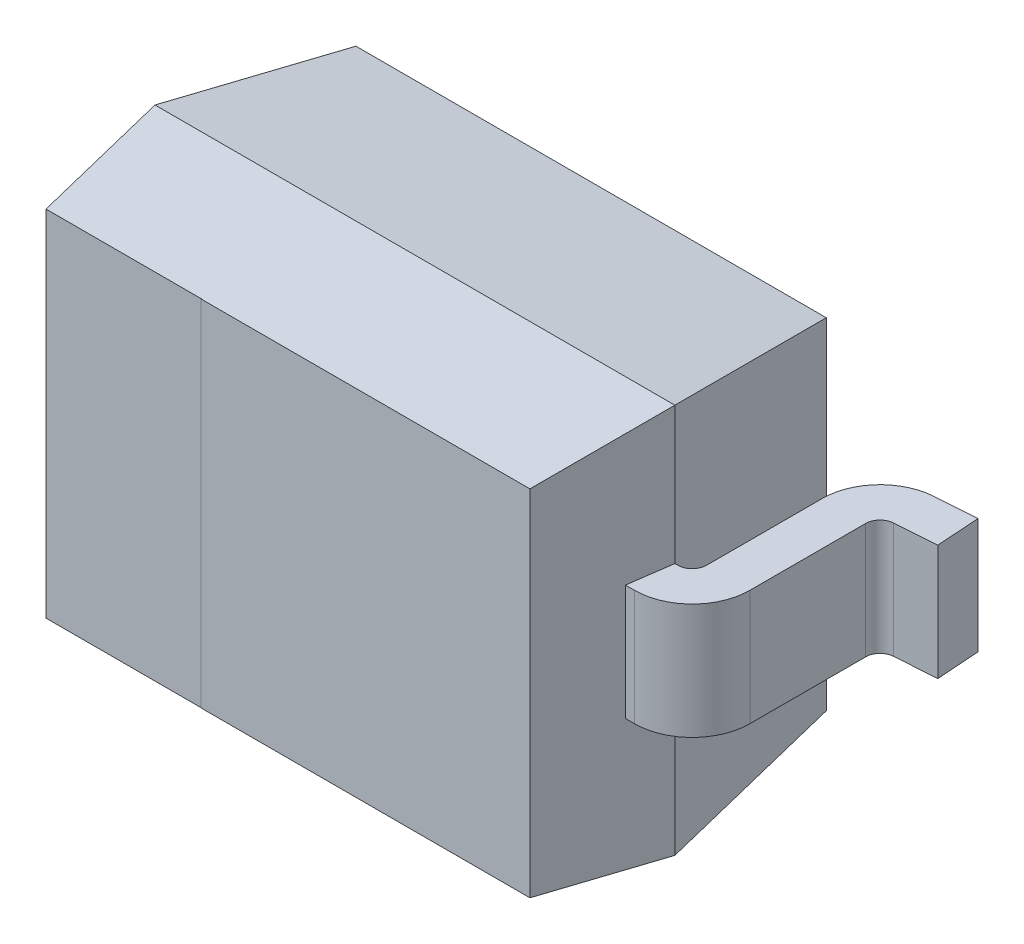
ISO-10303-21;
HEADER;
FILE_DESCRIPTION(('STEP AP214'),'2;1');
FILE_NAME('part.step','',(''),(''),'','','');
FILE_SCHEMA(('AUTOMOTIVE_DESIGN { 1 0 10303 214 1 1 1 1 }'));
ENDSEC;
DATA;
#1=APPLICATION_CONTEXT('core data for automotive mechanical design processes');
#2=APPLICATION_PROTOCOL_DEFINITION('international standard','automotive_design',2000,#1);
#3=PRODUCT_CONTEXT('',#1,'mechanical');
#4=PRODUCT('Part','Part','',(#3));
#5=PRODUCT_RELATED_PRODUCT_CATEGORY('part','',(#4));
#6=PRODUCT_DEFINITION_FORMATION('','',#4);
#7=PRODUCT_DEFINITION_CONTEXT('part definition',#1,'design');
#8=PRODUCT_DEFINITION('design','',#6,#7);
#9=PRODUCT_DEFINITION_SHAPE('','',#8);
#10=(LENGTH_UNIT() NAMED_UNIT(*) SI_UNIT(.MILLI.,.METRE.));
#11=(NAMED_UNIT(*) PLANE_ANGLE_UNIT() SI_UNIT($,.RADIAN.));
#12=(NAMED_UNIT(*) SI_UNIT($,.STERADIAN.) SOLID_ANGLE_UNIT());
#13=UNCERTAINTY_MEASURE_WITH_UNIT(LENGTH_MEASURE(1.E-05),#10,'distance_accuracy_value','');
#14=(GEOMETRIC_REPRESENTATION_CONTEXT(3) GLOBAL_UNCERTAINTY_ASSIGNED_CONTEXT((#13)) GLOBAL_UNIT_ASSIGNED_CONTEXT((#10,
#11,#12)) REPRESENTATION_CONTEXT('',''));
#15=CARTESIAN_POINT('',(0.,0.,0.));
#16=DIRECTION('',(0.,0.,1.));
#17=DIRECTION('',(1.,0.,0.));
#18=AXIS2_PLACEMENT_3D('',#15,#16,#17);
#19=CARTESIAN_POINT('',(-0.9,0.675,0.66));
#20=DIRECTION('',(0.,0.990268068741588,-0.139173100959942));
#21=DIRECTION('',(0.,0.139173100959942,0.990268068741588));
#22=AXIS2_PLACEMENT_3D('',#19,#20,#21);
#23=PLANE('',#22);
#24=DIRECTION('',(-0.137844537490919,-0.13784453749152,-0.980814848464104));
#25=VECTOR('',#24,1.);
#26=CARTESIAN_POINT('',(0.9,0.675,0.66));
#27=LINE('',#26,#25);
#28=CARTESIAN_POINT('',(0.9,0.674999999999998,0.66));
#29=VERTEX_POINT('',#28);
#30=CARTESIAN_POINT('',(0.814270090832,0.589270090831626,0.0500000000000525));
#31=VERTEX_POINT('',#30);
#32=EDGE_CURVE('E378',#29,#31,#27,.T.);
#33=ORIENTED_EDGE('',*,*,#32,.T.);
#34=DIRECTION('',(1.,0.,0.));
#35=VECTOR('',#34,1.);
#36=CARTESIAN_POINT('',(-0.9,0.589270090831626,0.0500000000000525));
#37=LINE('',#36,#35);
#38=CARTESIAN_POINT('',(-0.814270090832,0.589270090831626,0.0500000000000525));
#39=VERTEX_POINT('',#38);
#40=EDGE_CURVE('E364',#31,#39,#37,.F.);
#41=ORIENTED_EDGE('',*,*,#40,.T.);
#42=DIRECTION('',(-0.137844537490919,0.13784453749152,0.980814848464104));
#43=VECTOR('',#42,1.);
#44=CARTESIAN_POINT('',(-0.814270090832,0.589270090831626,0.0500000000000525));
#45=LINE('',#44,#43);
#46=CARTESIAN_POINT('',(-0.90000000000014,0.674999999999998,0.659999999999987));
#47=VERTEX_POINT('',#46);
#48=EDGE_CURVE('E376',#39,#47,#45,.T.);
#49=ORIENTED_EDGE('',*,*,#48,.T.);
#50=DIRECTION('',(1.,0.,0.));
#51=VECTOR('',#50,1.);
#52=CARTESIAN_POINT('',(-0.9,0.674999999999996,0.659999999999999));
#53=LINE('',#52,#51);
#54=EDGE_CURVE('E266',#29,#47,#53,.F.);
#55=ORIENTED_EDGE('',*,*,#54,.F.);
#56=EDGE_LOOP('',(#33,#41,#49,#55));
#57=FACE_BOUND('',#56,.T.);
#58=ADVANCED_FACE('F17',(#57),#23,.T.);
#59=CARTESIAN_POINT('',(0.96,0.2,0.61));
#60=DIRECTION('',(-1.,0.,0.));
#61=DIRECTION('',(0.,0.,1.));
#62=AXIS2_PLACEMENT_3D('',#59,#60,#61);
#63=PLANE('',#62);
#64=DIRECTION('',(0.,0.,-1.));
#65=VECTOR('',#64,1.);
#66=CARTESIAN_POINT('',(0.96,0.2,0.61));
#67=LINE('',#66,#65);
#68=CARTESIAN_POINT('',(0.96,0.2,0.61));
#69=VERTEX_POINT('',#68);
#70=CARTESIAN_POINT('',(0.96,0.2,0.209546456115));
#71=VERTEX_POINT('',#70);
#72=EDGE_CURVE('E435',#69,#71,#67,.T.);
#73=ORIENTED_EDGE('',*,*,#72,.T.);
#74=DIRECTION('',(0.,-1.,0.));
#75=VECTOR('',#74,1.);
#76=CARTESIAN_POINT('',(0.96,0.2,0.209546456115));
#77=LINE('',#76,#75);
#78=CARTESIAN_POINT('',(0.96,-0.2,0.209546456115));
#79=VERTEX_POINT('',#78);
#80=EDGE_CURVE('E362',#79,#71,#77,.F.);
#81=ORIENTED_EDGE('',*,*,#80,.F.);
#82=DIRECTION('',(0.,0.,-1.));
#83=VECTOR('',#82,1.);
#84=CARTESIAN_POINT('',(0.96,-0.2,0.61));
#85=LINE('',#84,#83);
#86=CARTESIAN_POINT('',(0.96,-0.2,0.61));
#87=VERTEX_POINT('',#86);
#88=EDGE_CURVE('E232',#87,#79,#85,.T.);
#89=ORIENTED_EDGE('',*,*,#88,.F.);
#90=DIRECTION('',(0.,-1.,0.));
#91=VECTOR('',#90,1.);
#92=CARTESIAN_POINT('',(0.96,0.2,0.61));
#93=LINE('',#92,#91);
#94=EDGE_CURVE('E228',#87,#69,#93,.F.);
#95=ORIENTED_EDGE('',*,*,#94,.T.);
#96=EDGE_LOOP('',(#73,#81,#89,#95));
#97=FACE_BOUND('',#96,.T.);
#98=ADVANCED_FACE('F774',(#97),#63,.T.);
#99=CARTESIAN_POINT('',(1.16,0.2,0.209546456115));
#100=DIRECTION('',(0.,-1.,0.));
#101=DIRECTION('',(0.,0.,-1.));
#102=AXIS2_PLACEMENT_3D('',#99,#100,#101);
#103=CYLINDRICAL_SURFACE('',#102,0.2);
#104=CARTESIAN_POINT('',(1.16,0.2,0.209546456115));
#105=DIRECTION('',(0.,-1.,0.));
#106=DIRECTION('',(0.,0.,-1.));
#107=AXIS2_PLACEMENT_3D('',#104,#105,#106);
#108=CIRCLE('',#107,0.2);
#109=CARTESIAN_POINT('',(1.14604870525108,0.2,0.0100336460631544));
#110=VERTEX_POINT('',#109);
#111=EDGE_CURVE('E432',#71,#110,#108,.T.);
#112=ORIENTED_EDGE('',*,*,#111,.T.);
#113=DIRECTION('',(0.,1.,0.));
#114=VECTOR('',#113,1.);
#115=CARTESIAN_POINT('',(1.146048705251,0.2,0.01003364606316));
#116=LINE('',#115,#114);
#117=CARTESIAN_POINT('',(1.14604870525108,-0.2,0.0100336460631544));
#118=VERTEX_POINT('',#117);
#119=EDGE_CURVE('E358',#118,#110,#116,.T.);
#120=ORIENTED_EDGE('',*,*,#119,.F.);
#121=CARTESIAN_POINT('',(1.16,-0.2,0.209546456115));
#122=DIRECTION('',(0.,-1.,0.));
#123=DIRECTION('',(0.,0.,-1.));
#124=AXIS2_PLACEMENT_3D('',#121,#122,#123);
#125=CIRCLE('',#124,0.2);
#126=EDGE_CURVE('E443',#79,#118,#125,.T.);
#127=ORIENTED_EDGE('',*,*,#126,.F.);
#128=ORIENTED_EDGE('',*,*,#80,.T.);
#129=EDGE_LOOP('',(#112,#120,#127,#128));
#130=FACE_BOUND('',#129,.T.);
#131=ADVANCED_FACE('F771',(#130),#103,.T.);
#132=CARTESIAN_POINT('',(1.146048705251,0.2,0.01003364606316));
#133=DIRECTION('',(-0.0697564737441078,0.,-0.997564050259826));
#134=DIRECTION('',(-0.997564050259825,0.,0.0697564737441078));
#135=AXIS2_PLACEMENT_3D('',#132,#133,#134);
#136=PLANE('',#135);
#137=DIRECTION('',(0.997564050259817,0.,-0.069756473744233));
#138=VECTOR('',#137,1.);
#139=CARTESIAN_POINT('',(1.146048705251,0.2,0.01003364606316));
#140=LINE('',#139,#138);
#141=CARTESIAN_POINT('',(1.289536528938,0.2,0.));
#142=VERTEX_POINT('',#141);
#143=EDGE_CURVE('E354',#110,#142,#140,.T.);
#144=ORIENTED_EDGE('',*,*,#143,.T.);
#145=DIRECTION('',(0.,1.,0.));
#146=VECTOR('',#145,1.);
#147=CARTESIAN_POINT('',(1.289536528938,0.2,0.));
#148=LINE('',#147,#146);
#149=CARTESIAN_POINT('',(1.289536528938,-0.2,0.));
#150=VERTEX_POINT('',#149);
#151=EDGE_CURVE('E347',#150,#142,#148,.T.);
#152=ORIENTED_EDGE('',*,*,#151,.F.);
#153=DIRECTION('',(0.997564050259817,0.,-0.069756473744233));
#154=VECTOR('',#153,1.);
#155=CARTESIAN_POINT('',(1.146048705251,-0.2,0.01003364606316));
#156=LINE('',#155,#154);
#157=EDGE_CURVE('E369',#118,#150,#156,.T.);
#158=ORIENTED_EDGE('',*,*,#157,.F.);
#159=ORIENTED_EDGE('',*,*,#119,.T.);
#160=EDGE_LOOP('',(#144,#152,#158,#159));
#161=FACE_BOUND('',#160,.T.);
#162=ADVANCED_FACE('F767',(#161),#136,.T.);
#163=CARTESIAN_POINT('',(1.289536528938,0.2,0.));
#164=DIRECTION('',(0.997564050259826,0.,-0.0697564737441078));
#165=DIRECTION('',(-0.0697564737441078,0.,-0.997564050259825));
#166=AXIS2_PLACEMENT_3D('',#163,#164,#165);
#167=PLANE('',#166);
#168=DIRECTION('',(0.0697564737466421,0.,0.997564050259648));
#169=VECTOR('',#168,1.);
#170=CARTESIAN_POINT('',(1.289536528938,0.2,0.));
#171=LINE('',#170,#169);
#172=CARTESIAN_POINT('',(1.3,0.2,0.149634607539));
#173=VERTEX_POINT('',#172);
#174=EDGE_CURVE('E350',#142,#173,#171,.T.);
#175=ORIENTED_EDGE('',*,*,#174,.T.);
#176=DIRECTION('',(0.,1.,0.));
#177=VECTOR('',#176,1.);
#178=CARTESIAN_POINT('',(1.3,0.2,0.149634607539));
#179=LINE('',#178,#177);
#180=CARTESIAN_POINT('',(1.3,-0.2,0.149634607539));
#181=VERTEX_POINT('',#180);
#182=EDGE_CURVE('E345',#181,#173,#179,.T.);
#183=ORIENTED_EDGE('',*,*,#182,.F.);
#184=DIRECTION('',(0.0697564737466421,0.,0.997564050259648));
#185=VECTOR('',#184,1.);
#186=CARTESIAN_POINT('',(1.289536528938,-0.2,0.));
#187=LINE('',#186,#185);
#188=EDGE_CURVE('E366',#150,#181,#187,.T.);
#189=ORIENTED_EDGE('',*,*,#188,.F.);
#190=ORIENTED_EDGE('',*,*,#151,.T.);
#191=EDGE_LOOP('',(#175,#183,#189,#190));
#192=FACE_BOUND('',#191,.T.);
#193=ADVANCED_FACE('F764',(#192),#167,.T.);
#194=CARTESIAN_POINT('',(1.3,0.2,0.149634607539));
#195=DIRECTION('',(0.0697564737441078,0.,0.997564050259826));
#196=DIRECTION('',(0.997564050259825,0.,-0.0697564737441078));
#197=AXIS2_PLACEMENT_3D('',#194,#195,#196);
#198=PLANE('',#197);
#199=DIRECTION('',(-0.997564050259894,0.,0.0697564737431262));
#200=VECTOR('',#199,1.);
#201=CARTESIAN_POINT('',(1.3,0.2,0.149634607539));
#202=LINE('',#201,#200);
#203=CARTESIAN_POINT('',(1.15651217631292,0.2,0.159668253602003));
#204=VERTEX_POINT('',#203);
#205=EDGE_CURVE('E353',#173,#204,#202,.T.);
#206=ORIENTED_EDGE('',*,*,#205,.T.);
#207=DIRECTION('',(0.,-1.,0.));
#208=VECTOR('',#207,1.);
#209=CARTESIAN_POINT('',(1.156512176313,0.2,0.159668253601994));
#210=LINE('',#209,#208);
#211=CARTESIAN_POINT('',(1.15651217631292,-0.2,0.159668253602003));
#212=VERTEX_POINT('',#211);
#213=EDGE_CURVE('E342',#204,#212,#210,.T.);
#214=ORIENTED_EDGE('',*,*,#213,.T.);
#215=DIRECTION('',(-0.997564050259894,0.,0.0697564737431262));
#216=VECTOR('',#215,1.);
#217=CARTESIAN_POINT('',(1.3,-0.2,0.149634607539));
#218=LINE('',#217,#216);
#219=EDGE_CURVE('E368',#181,#212,#218,.T.);
#220=ORIENTED_EDGE('',*,*,#219,.F.);
#221=ORIENTED_EDGE('',*,*,#182,.T.);
#222=EDGE_LOOP('',(#206,#214,#220,#221));
#223=FACE_BOUND('',#222,.T.);
#224=ADVANCED_FACE('F592',(#223),#198,.T.);
#225=CARTESIAN_POINT('',(1.16,0.2,0.209546456115));
#226=DIRECTION('',(0.,-1.,0.));
#227=DIRECTION('',(0.,0.,-1.));
#228=AXIS2_PLACEMENT_3D('',#225,#226,#227);
#229=CYLINDRICAL_SURFACE('',#228,0.05);
#230=ORIENTED_EDGE('',*,*,#213,.F.);
#231=CARTESIAN_POINT('',(1.16,0.2,0.209546456115));
#232=DIRECTION('',(0.,-1.,0.));
#233=DIRECTION('',(0.,0.,-1.));
#234=AXIS2_PLACEMENT_3D('',#231,#232,#233);
#235=CIRCLE('',#234,0.05);
#236=CARTESIAN_POINT('',(1.11,0.2,0.209546456115));
#237=VERTEX_POINT('',#236);
#238=EDGE_CURVE('E429',#204,#237,#235,.F.);
#239=ORIENTED_EDGE('',*,*,#238,.T.);
#240=DIRECTION('',(0.,1.,0.));
#241=VECTOR('',#240,1.);
#242=CARTESIAN_POINT('',(1.11,0.2,0.209546456115));
#243=LINE('',#242,#241);
#244=CARTESIAN_POINT('',(1.11,-0.2,0.209546456115));
#245=VERTEX_POINT('',#244);
#246=EDGE_CURVE('E340',#245,#237,#243,.T.);
#247=ORIENTED_EDGE('',*,*,#246,.F.);
#248=CARTESIAN_POINT('',(1.16,-0.2,0.209546456115));
#249=DIRECTION('',(0.,-1.,0.));
#250=DIRECTION('',(0.,0.,-1.));
#251=AXIS2_PLACEMENT_3D('',#248,#249,#250);
#252=CIRCLE('',#251,0.05);
#253=EDGE_CURVE('E442',#212,#245,#252,.F.);
#254=ORIENTED_EDGE('',*,*,#253,.F.);
#255=EDGE_LOOP('',(#230,#239,#247,#254));
#256=FACE_BOUND('',#255,.T.);
#257=ADVANCED_FACE('F596',(#256),#229,.F.);
#258=CARTESIAN_POINT('',(1.11,0.2,0.209546456115));
#259=DIRECTION('',(1.,0.,0.));
#260=DIRECTION('',(0.,0.,-1.));
#261=AXIS2_PLACEMENT_3D('',#258,#259,#260);
#262=PLANE('',#261);
#263=DIRECTION('',(0.,0.,-1.));
#264=VECTOR('',#263,1.);
#265=CARTESIAN_POINT('',(1.11,0.2,0.61));
#266=LINE('',#265,#264);
#267=CARTESIAN_POINT('',(1.11,0.2,0.61));
#268=VERTEX_POINT('',#267);
#269=EDGE_CURVE('E428',#237,#268,#266,.F.);
#270=ORIENTED_EDGE('',*,*,#269,.T.);
#271=DIRECTION('',(0.,-1.,0.));
#272=VECTOR('',#271,1.);
#273=CARTESIAN_POINT('',(1.11,0.2,0.61));
#274=LINE('',#273,#272);
#275=CARTESIAN_POINT('',(1.11,-0.2,0.61));
#276=VERTEX_POINT('',#275);
#277=EDGE_CURVE('E321',#276,#268,#274,.F.);
#278=ORIENTED_EDGE('',*,*,#277,.F.);
#279=DIRECTION('',(0.,0.,-1.));
#280=VECTOR('',#279,1.);
#281=CARTESIAN_POINT('',(1.11,-0.2,0.61));
#282=LINE('',#281,#280);
#283=EDGE_CURVE('E441',#245,#276,#282,.F.);
#284=ORIENTED_EDGE('',*,*,#283,.F.);
#285=ORIENTED_EDGE('',*,*,#246,.T.);
#286=EDGE_LOOP('',(#270,#278,#284,#285));
#287=FACE_BOUND('',#286,.T.);
#288=ADVANCED_FACE('F601',(#287),#262,.T.);
#289=CARTESIAN_POINT('',(0.91,0.2,0.61));
#290=DIRECTION('',(0.,-1.,0.));
#291=DIRECTION('',(0.,0.,-1.));
#292=AXIS2_PLACEMENT_3D('',#289,#290,#291);
#293=CYLINDRICAL_SURFACE('',#292,0.2);
#294=CARTESIAN_POINT('',(0.91,0.2,0.61));
#295=DIRECTION('',(0.,-1.,0.));
#296=DIRECTION('',(0.,0.,-1.));
#297=AXIS2_PLACEMENT_3D('',#294,#295,#296);
#298=CIRCLE('',#297,0.2);
#299=CARTESIAN_POINT('',(0.91,0.2,0.81));
#300=VERTEX_POINT('',#299);
#301=EDGE_CURVE('E425',#268,#300,#298,.T.);
#302=ORIENTED_EDGE('',*,*,#301,.T.);
#303=DIRECTION('',(0.,1.,0.));
#304=VECTOR('',#303,1.);
#305=CARTESIAN_POINT('',(0.91,0.2,0.81));
#306=LINE('',#305,#304);
#307=CARTESIAN_POINT('',(0.91,-0.2,0.81));
#308=VERTEX_POINT('',#307);
#309=EDGE_CURVE('E333',#308,#300,#306,.T.);
#310=ORIENTED_EDGE('',*,*,#309,.F.);
#311=CARTESIAN_POINT('',(0.91,-0.2,0.61));
#312=DIRECTION('',(0.,-1.,0.));
#313=DIRECTION('',(0.,0.,-1.));
#314=AXIS2_PLACEMENT_3D('',#311,#312,#313);
#315=CIRCLE('',#314,0.2);
#316=EDGE_CURVE('E438',#276,#308,#315,.T.);
#317=ORIENTED_EDGE('',*,*,#316,.F.);
#318=ORIENTED_EDGE('',*,*,#277,.T.);
#319=EDGE_LOOP('',(#302,#310,#317,#318));
#320=FACE_BOUND('',#319,.T.);
#321=ADVANCED_FACE('F754',(#320),#293,.T.);
#322=CARTESIAN_POINT('',(-0.91,0.2,0.61));
#323=DIRECTION('',(0.,-1.,0.));
#324=DIRECTION('',(0.,0.,-1.));
#325=AXIS2_PLACEMENT_3D('',#322,#323,#324);
#326=CYLINDRICAL_SURFACE('',#325,0.2);
#327=CARTESIAN_POINT('',(-0.91,0.2,0.61));
#328=DIRECTION('',(0.,-1.,0.));
#329=DIRECTION('',(0.,0.,-1.));
#330=AXIS2_PLACEMENT_3D('',#327,#328,#329);
#331=CIRCLE('',#330,0.2);
#332=CARTESIAN_POINT('',(-0.91,0.2,0.81));
#333=VERTEX_POINT('',#332);
#334=CARTESIAN_POINT('',(-1.11,0.2,0.61));
#335=VERTEX_POINT('',#334);
#336=EDGE_CURVE('E324',#333,#335,#331,.T.);
#337=ORIENTED_EDGE('',*,*,#336,.T.);
#338=DIRECTION('',(0.,1.,0.));
#339=VECTOR('',#338,1.);
#340=CARTESIAN_POINT('',(-1.11,0.2,0.61));
#341=LINE('',#340,#339);
#342=CARTESIAN_POINT('',(-1.11,-0.2,0.61));
#343=VERTEX_POINT('',#342);
#344=EDGE_CURVE('E318',#335,#343,#341,.F.);
#345=ORIENTED_EDGE('',*,*,#344,.T.);
#346=CARTESIAN_POINT('',(-0.91,-0.2,0.61));
#347=DIRECTION('',(0.,-1.,0.));
#348=DIRECTION('',(0.,0.,-1.));
#349=AXIS2_PLACEMENT_3D('',#346,#347,#348);
#350=CIRCLE('',#349,0.2);
#351=CARTESIAN_POINT('',(-0.91,-0.2,0.81));
#352=VERTEX_POINT('',#351);
#353=EDGE_CURVE('E289',#352,#343,#350,.T.);
#354=ORIENTED_EDGE('',*,*,#353,.F.);
#355=DIRECTION('',(0.,1.,0.));
#356=VECTOR('',#355,1.);
#357=CARTESIAN_POINT('',(-0.91,0.2,0.81));
#358=LINE('',#357,#356);
#359=EDGE_CURVE('E274',#352,#333,#358,.T.);
#360=ORIENTED_EDGE('',*,*,#359,.T.);
#361=EDGE_LOOP('',(#337,#345,#354,#360));
#362=FACE_BOUND('',#361,.T.);
#363=ADVANCED_FACE('F750',(#362),#326,.T.);
#364=CARTESIAN_POINT('',(-1.11,0.2,0.209546456115));
#365=DIRECTION('',(1.,0.,0.));
#366=DIRECTION('',(0.,0.,-1.));
#367=AXIS2_PLACEMENT_3D('',#364,#365,#366);
#368=PLANE('',#367);
#369=ORIENTED_EDGE('',*,*,#344,.F.);
#370=DIRECTION('',(0.,0.,-1.));
#371=VECTOR('',#370,1.);
#372=CARTESIAN_POINT('',(-1.11,0.2,0.61));
#373=LINE('',#372,#371);
#374=CARTESIAN_POINT('',(-1.11,0.2,0.209546456115));
#375=VERTEX_POINT('',#374);
#376=EDGE_CURVE('E414',#335,#375,#373,.T.);
#377=ORIENTED_EDGE('',*,*,#376,.T.);
#378=DIRECTION('',(0.,-1.,0.));
#379=VECTOR('',#378,1.);
#380=CARTESIAN_POINT('',(-1.11,0.2,0.209546456115));
#381=LINE('',#380,#379);
#382=CARTESIAN_POINT('',(-1.11,-0.2,0.209546456115));
#383=VERTEX_POINT('',#382);
#384=EDGE_CURVE('E315',#375,#383,#381,.T.);
#385=ORIENTED_EDGE('',*,*,#384,.T.);
#386=DIRECTION('',(0.,0.,-1.));
#387=VECTOR('',#386,1.);
#388=CARTESIAN_POINT('',(-1.11,-0.2,0.61));
#389=LINE('',#388,#387);
#390=EDGE_CURVE('E423',#343,#383,#389,.T.);
#391=ORIENTED_EDGE('',*,*,#390,.F.);
#392=EDGE_LOOP('',(#369,#377,#385,#391));
#393=FACE_BOUND('',#392,.T.);
#394=ADVANCED_FACE('F746',(#393),#368,.F.);
#395=CARTESIAN_POINT('',(-1.16,0.2,0.209546456115));
#396=DIRECTION('',(0.,-1.,0.));
#397=DIRECTION('',(0.,0.,-1.));
#398=AXIS2_PLACEMENT_3D('',#395,#396,#397);
#399=CYLINDRICAL_SURFACE('',#398,0.05);
#400=ORIENTED_EDGE('',*,*,#384,.F.);
#401=CARTESIAN_POINT('',(-1.16,0.2,0.209546456115));
#402=DIRECTION('',(0.,-1.,0.));
#403=DIRECTION('',(0.,0.,-1.));
#404=AXIS2_PLACEMENT_3D('',#401,#402,#403);
#405=CIRCLE('',#404,0.05);
#406=CARTESIAN_POINT('',(-1.15651217631293,0.2,0.159668253602076));
#407=VERTEX_POINT('',#406);
#408=EDGE_CURVE('E411',#375,#407,#405,.F.);
#409=ORIENTED_EDGE('',*,*,#408,.T.);
#410=DIRECTION('',(0.,1.,0.));
#411=VECTOR('',#410,1.);
#412=CARTESIAN_POINT('',(-1.15651217631301,0.2,0.159668253602141));
#413=LINE('',#412,#411);
#414=CARTESIAN_POINT('',(-1.15651217631293,-0.2,0.159668253602076));
#415=VERTEX_POINT('',#414);
#416=EDGE_CURVE('E310',#407,#415,#413,.F.);
#417=ORIENTED_EDGE('',*,*,#416,.T.);
#418=CARTESIAN_POINT('',(-1.16,-0.2,0.209546456115));
#419=DIRECTION('',(0.,-1.,0.));
#420=DIRECTION('',(0.,0.,-1.));
#421=AXIS2_PLACEMENT_3D('',#418,#419,#420);
#422=CIRCLE('',#421,0.05);
#423=EDGE_CURVE('E421',#383,#415,#422,.F.);
#424=ORIENTED_EDGE('',*,*,#423,.F.);
#425=EDGE_LOOP('',(#400,#409,#417,#424));
#426=FACE_BOUND('',#425,.T.);
#427=ADVANCED_FACE('F742',(#426),#399,.F.);
#428=CARTESIAN_POINT('',(-1.3,0.2,0.149634607539));
#429=DIRECTION('',(0.0697564737441078,0.,-0.997564050259826));
#430=DIRECTION('',(-0.997564050259825,0.,-0.0697564737441078));
#431=AXIS2_PLACEMENT_3D('',#428,#429,#430);
#432=PLANE('',#431);
#433=ORIENTED_EDGE('',*,*,#416,.F.);
#434=DIRECTION('',(-0.997564050259894,0.,-0.0697564737431262));
#435=VECTOR('',#434,1.);
#436=CARTESIAN_POINT('',(-1.156512176313,0.2,0.159668253602));
#437=LINE('',#436,#435);
#438=CARTESIAN_POINT('',(-1.29999999999987,0.2,0.149634607539009));
#439=VERTEX_POINT('',#438);
#440=EDGE_CURVE('E305',#407,#439,#437,.T.);
#441=ORIENTED_EDGE('',*,*,#440,.T.);
#442=DIRECTION('',(0.,1.,0.));
#443=VECTOR('',#442,1.);
#444=CARTESIAN_POINT('',(-1.29999999999962,0.2,0.149634607539027));
#445=LINE('',#444,#443);
#446=CARTESIAN_POINT('',(-1.29999999999987,-0.2,0.149634607539009));
#447=VERTEX_POINT('',#446);
#448=EDGE_CURVE('E298',#439,#447,#445,.F.);
#449=ORIENTED_EDGE('',*,*,#448,.T.);
#450=DIRECTION('',(-0.997564050259894,0.,-0.0697564737431262));
#451=VECTOR('',#450,1.);
#452=CARTESIAN_POINT('',(-1.156512176313,-0.2,0.159668253602));
#453=LINE('',#452,#451);
#454=EDGE_CURVE('E330',#415,#447,#453,.T.);
#455=ORIENTED_EDGE('',*,*,#454,.F.);
#456=EDGE_LOOP('',(#433,#441,#449,#455));
#457=FACE_BOUND('',#456,.T.);
#458=ADVANCED_FACE('F738',(#457),#432,.F.);
#459=CARTESIAN_POINT('',(-1.289536528938,0.2,0.));
#460=DIRECTION('',(0.997564050259826,0.,0.0697564737441078));
#461=DIRECTION('',(0.0697564737441078,0.,-0.997564050259825));
#462=AXIS2_PLACEMENT_3D('',#459,#460,#461);
#463=PLANE('',#462);
#464=ORIENTED_EDGE('',*,*,#448,.F.);
#465=DIRECTION('',(0.0697564737466421,0.,-0.997564050259648));
#466=VECTOR('',#465,1.);
#467=CARTESIAN_POINT('',(-1.3,0.2,0.149634607539));
#468=LINE('',#467,#466);
#469=CARTESIAN_POINT('',(-1.289536528938,0.2,0.));
#470=VERTEX_POINT('',#469);
#471=EDGE_CURVE('E301',#439,#470,#468,.T.);
#472=ORIENTED_EDGE('',*,*,#471,.T.);
#473=DIRECTION('',(0.,1.,0.));
#474=VECTOR('',#473,1.);
#475=CARTESIAN_POINT('',(-1.289536528938,0.2,0.));
#476=LINE('',#475,#474);
#477=CARTESIAN_POINT('',(-1.289536528938,-0.2,0.));
#478=VERTEX_POINT('',#477);
#479=EDGE_CURVE('E295',#470,#478,#476,.F.);
#480=ORIENTED_EDGE('',*,*,#479,.T.);
#481=DIRECTION('',(0.0697564737466421,0.,-0.997564050259648));
#482=VECTOR('',#481,1.);
#483=CARTESIAN_POINT('',(-1.3,-0.2,0.149634607539));
#484=LINE('',#483,#482);
#485=EDGE_CURVE('E327',#447,#478,#484,.T.);
#486=ORIENTED_EDGE('',*,*,#485,.F.);
#487=EDGE_LOOP('',(#464,#472,#480,#486));
#488=FACE_BOUND('',#487,.T.);
#489=ADVANCED_FACE('F734',(#488),#463,.F.);
#490=CARTESIAN_POINT('',(-1.146048705251,0.2,0.01003364606316));
#491=DIRECTION('',(-0.0697564737441078,0.,0.997564050259826));
#492=DIRECTION('',(0.997564050259825,0.,0.0697564737441078));
#493=AXIS2_PLACEMENT_3D('',#490,#491,#492);
#494=PLANE('',#493);
#495=ORIENTED_EDGE('',*,*,#479,.F.);
#496=DIRECTION('',(0.997564050259817,0.,0.069756473744233));
#497=VECTOR('',#496,1.);
#498=CARTESIAN_POINT('',(-1.289536528938,0.2,0.));
#499=LINE('',#498,#497);
#500=CARTESIAN_POINT('',(-1.14604870525108,0.2,0.0100336460630983));
#501=VERTEX_POINT('',#500);
#502=EDGE_CURVE('E304',#470,#501,#499,.T.);
#503=ORIENTED_EDGE('',*,*,#502,.T.);
#504=DIRECTION('',(0.,-1.,0.));
#505=VECTOR('',#504,1.);
#506=CARTESIAN_POINT('',(-1.14604870525099,0.2,0.0100336460630479));
#507=LINE('',#506,#505);
#508=CARTESIAN_POINT('',(-1.14604870525108,-0.2,0.0100336460630983));
#509=VERTEX_POINT('',#508);
#510=EDGE_CURVE('E293',#509,#501,#507,.F.);
#511=ORIENTED_EDGE('',*,*,#510,.F.);
#512=DIRECTION('',(0.997564050259817,0.,0.069756473744233));
#513=VECTOR('',#512,1.);
#514=CARTESIAN_POINT('',(-1.289536528938,-0.2,0.));
#515=LINE('',#514,#513);
#516=EDGE_CURVE('E329',#478,#509,#515,.T.);
#517=ORIENTED_EDGE('',*,*,#516,.F.);
#518=EDGE_LOOP('',(#495,#503,#511,#517));
#519=FACE_BOUND('',#518,.T.);
#520=ADVANCED_FACE('F730',(#519),#494,.F.);
#521=CARTESIAN_POINT('',(-1.16,0.2,0.209546456115));
#522=DIRECTION('',(0.,-1.,0.));
#523=DIRECTION('',(0.,0.,-1.));
#524=AXIS2_PLACEMENT_3D('',#521,#522,#523);
#525=CYLINDRICAL_SURFACE('',#524,0.2);
#526=CARTESIAN_POINT('',(-1.16,0.2,0.209546456115));
#527=DIRECTION('',(0.,-1.,0.));
#528=DIRECTION('',(0.,0.,-1.));
#529=AXIS2_PLACEMENT_3D('',#526,#527,#528);
#530=CIRCLE('',#529,0.2);
#531=CARTESIAN_POINT('',(-0.96,0.2,0.209546456115));
#532=VERTEX_POINT('',#531);
#533=EDGE_CURVE('E408',#501,#532,#530,.T.);
#534=ORIENTED_EDGE('',*,*,#533,.T.);
#535=DIRECTION('',(0.,1.,0.));
#536=VECTOR('',#535,1.);
#537=CARTESIAN_POINT('',(-0.96,0.2,0.209546456115));
#538=LINE('',#537,#536);
#539=CARTESIAN_POINT('',(-0.96,-0.2,0.209546456115));
#540=VERTEX_POINT('',#539);
#541=EDGE_CURVE('E267',#532,#540,#538,.F.);
#542=ORIENTED_EDGE('',*,*,#541,.T.);
#543=CARTESIAN_POINT('',(-1.16,-0.2,0.209546456115));
#544=DIRECTION('',(0.,-1.,0.));
#545=DIRECTION('',(0.,0.,-1.));
#546=AXIS2_PLACEMENT_3D('',#543,#544,#545);
#547=CIRCLE('',#546,0.2);
#548=EDGE_CURVE('E419',#509,#540,#547,.T.);
#549=ORIENTED_EDGE('',*,*,#548,.F.);
#550=ORIENTED_EDGE('',*,*,#510,.T.);
#551=EDGE_LOOP('',(#534,#542,#549,#550));
#552=FACE_BOUND('',#551,.T.);
#553=ADVANCED_FACE('F726',(#552),#525,.T.);
#554=CARTESIAN_POINT('',(-0.96,0.2,0.61));
#555=DIRECTION('',(-1.,0.,0.));
#556=DIRECTION('',(0.,0.,1.));
#557=AXIS2_PLACEMENT_3D('',#554,#555,#556);
#558=PLANE('',#557);
#559=ORIENTED_EDGE('',*,*,#541,.F.);
#560=DIRECTION('',(0.,0.,-1.));
#561=VECTOR('',#560,1.);
#562=CARTESIAN_POINT('',(-0.96,0.2,0.61));
#563=LINE('',#562,#561);
#564=CARTESIAN_POINT('',(-0.96,0.2,0.61));
#565=VERTEX_POINT('',#564);
#566=EDGE_CURVE('E407',#532,#565,#563,.F.);
#567=ORIENTED_EDGE('',*,*,#566,.T.);
#568=DIRECTION('',(0.,-1.,0.));
#569=VECTOR('',#568,1.);
#570=CARTESIAN_POINT('',(-0.96,0.2,0.61));
#571=LINE('',#570,#569);
#572=CARTESIAN_POINT('',(-0.96,-0.2,0.61));
#573=VERTEX_POINT('',#572);
#574=EDGE_CURVE('E286',#565,#573,#571,.T.);
#575=ORIENTED_EDGE('',*,*,#574,.T.);
#576=DIRECTION('',(0.,0.,-1.));
#577=VECTOR('',#576,1.);
#578=CARTESIAN_POINT('',(-0.96,-0.2,0.61));
#579=LINE('',#578,#577);
#580=EDGE_CURVE('E418',#540,#573,#579,.F.);
#581=ORIENTED_EDGE('',*,*,#580,.F.);
#582=EDGE_LOOP('',(#559,#567,#575,#581));
#583=FACE_BOUND('',#582,.T.);
#584=ADVANCED_FACE('F723',(#583),#558,.F.);
#585=CARTESIAN_POINT('',(-0.9,0.613162032731,1.1));
#586=DIRECTION('',(0.,0.990268068741588,0.139173100959942));
#587=DIRECTION('',(0.,-0.139173100959942,0.990268068741588));
#588=AXIS2_PLACEMENT_3D('',#585,#586,#587);
#589=PLANE('',#588);
#590=DIRECTION('',(0.137844537490877,-0.137844537491521,0.98081484846411));
#591=VECTOR('',#590,1.);
#592=CARTESIAN_POINT('',(-0.9,0.674999999999996,0.659999999999999));
#593=LINE('',#592,#591);
#594=CARTESIAN_POINT('',(-0.838302573565808,0.613302573565903,1.09899999999997));
#595=VERTEX_POINT('',#594);
#596=EDGE_CURVE('E270',#47,#595,#593,.T.);
#597=ORIENTED_EDGE('',*,*,#596,.T.);
#598=DIRECTION('',(-1.,0.,0.));
#599=VECTOR('',#598,1.);
#600=CARTESIAN_POINT('',(0.,0.613302573566,1.099));
#601=LINE('',#600,#599);
#602=CARTESIAN_POINT('',(-0.3,0.613302573565851,1.099));
#603=VERTEX_POINT('',#602);
#604=EDGE_CURVE('E494',#595,#603,#601,.F.);
#605=ORIENTED_EDGE('',*,*,#604,.T.);
#606=DIRECTION('',(0.,-0.139173100959942,0.990268068741588));
#607=VECTOR('',#606,1.);
#608=CARTESIAN_POINT('',(-0.3,0.613162032731,1.1));
#609=LINE('',#608,#607);
#610=CARTESIAN_POINT('',(-0.3,0.613162032731,1.1));
#611=VERTEX_POINT('',#610);
#612=EDGE_CURVE('E401',#603,#611,#609,.T.);
#613=ORIENTED_EDGE('',*,*,#612,.T.);
#614=DIRECTION('',(-1.,0.,0.));
#615=VECTOR('',#614,1.);
#616=CARTESIAN_POINT('',(-0.838162032731,0.613162032731,1.1));
#617=LINE('',#616,#615);
#618=CARTESIAN_POINT('',(0.838162032731,0.613162032731,1.1));
#619=VERTEX_POINT('',#618);
#620=EDGE_CURVE('E248',#611,#619,#617,.F.);
#621=ORIENTED_EDGE('',*,*,#620,.T.);
#622=DIRECTION('',(0.137844537491517,0.137844537491508,-0.980814848464022));
#623=VECTOR('',#622,1.);
#624=CARTESIAN_POINT('',(0.838162032731,0.613162032731,1.1));
#625=LINE('',#624,#623);
#626=EDGE_CURVE('E264',#619,#29,#625,.T.);
#627=ORIENTED_EDGE('',*,*,#626,.T.);
#628=ORIENTED_EDGE('',*,*,#54,.T.);
#629=EDGE_LOOP('',(#597,#605,#613,#621,#627,#628));
#630=FACE_BOUND('',#629,.T.);
#631=ADVANCED_FACE('F624',(#630),#589,.T.);
#632=CARTESIAN_POINT('',(0.91,0.2,0.61));
#633=DIRECTION('',(0.,-1.,0.));
#634=DIRECTION('',(0.,0.,-1.));
#635=AXIS2_PLACEMENT_3D('',#632,#633,#634);
#636=CYLINDRICAL_SURFACE('',#635,0.05);
#637=DIRECTION('',(0.,1.,0.));
#638=VECTOR('',#637,1.);
#639=CARTESIAN_POINT('',(0.91,0.2,0.66));
#640=LINE('',#639,#638);
#641=CARTESIAN_POINT('',(0.91,0.2,0.66));
#642=VERTEX_POINT('',#641);
#643=CARTESIAN_POINT('',(0.91,-0.2,0.66));
#644=VERTEX_POINT('',#643);
#645=EDGE_CURVE('E227',#642,#644,#640,.F.);
#646=ORIENTED_EDGE('',*,*,#645,.F.);
#647=CARTESIAN_POINT('',(0.91,0.2,0.61));
#648=DIRECTION('',(0.,-1.,0.));
#649=DIRECTION('',(0.,0.,-1.));
#650=AXIS2_PLACEMENT_3D('',#647,#648,#649);
#651=CIRCLE('',#650,0.05);
#652=EDGE_CURVE('E436',#642,#69,#651,.F.);
#653=ORIENTED_EDGE('',*,*,#652,.T.);
#654=ORIENTED_EDGE('',*,*,#94,.F.);
#655=CARTESIAN_POINT('',(0.91,-0.2,0.61));
#656=DIRECTION('',(0.,-1.,0.));
#657=DIRECTION('',(0.,0.,-1.));
#658=AXIS2_PLACEMENT_3D('',#655,#656,#657);
#659=CIRCLE('',#658,0.05);
#660=EDGE_CURVE('E20',#644,#87,#659,.F.);
#661=ORIENTED_EDGE('',*,*,#660,.F.);
#662=EDGE_LOOP('',(#646,#653,#654,#661));
#663=FACE_BOUND('',#662,.T.);
#664=ADVANCED_FACE('F225',(#663),#636,.F.);
#665=CARTESIAN_POINT('',(0.91,0.2,0.81));
#666=DIRECTION('',(0.,0.,1.));
#667=DIRECTION('',(1.,0.,0.));
#668=AXIS2_PLACEMENT_3D('',#665,#666,#667);
#669=PLANE('',#668);
#670=DIRECTION('',(1.,0.,0.));
#671=VECTOR('',#670,1.);
#672=CARTESIAN_POINT('',(0.91,0.2,0.81));
#673=LINE('',#672,#671);
#674=CARTESIAN_POINT('',(0.878918874794832,0.2,0.809999999999976));
#675=VERTEX_POINT('',#674);
#676=EDGE_CURVE('E290',#300,#675,#673,.F.);
#677=ORIENTED_EDGE('',*,*,#676,.T.);
#678=DIRECTION('',(0.,1.,0.));
#679=VECTOR('',#678,1.);
#680=CARTESIAN_POINT('',(0.878918874794663,2.5,0.809999999999953));
#681=LINE('',#680,#679);
#682=CARTESIAN_POINT('',(0.878918874794776,-0.2,0.809999999999968));
#683=VERTEX_POINT('',#682);
#684=EDGE_CURVE('E242',#675,#683,#681,.F.);
#685=ORIENTED_EDGE('',*,*,#684,.T.);
#686=DIRECTION('',(1.,0.,0.));
#687=VECTOR('',#686,1.);
#688=CARTESIAN_POINT('',(0.91,-0.2,0.81));
#689=LINE('',#688,#687);
#690=EDGE_CURVE('E233',#308,#683,#689,.F.);
#691=ORIENTED_EDGE('',*,*,#690,.F.);
#692=ORIENTED_EDGE('',*,*,#309,.T.);
#693=EDGE_LOOP('',(#677,#685,#691,#692));
#694=FACE_BOUND('',#693,.T.);
#695=ADVANCED_FACE('F606',(#694),#669,.T.);
#696=CARTESIAN_POINT('',(0.91,-0.2,0.61));
#697=DIRECTION('',(0.,-1.,0.));
#698=DIRECTION('',(0.,0.,-1.));
#699=AXIS2_PLACEMENT_3D('',#696,#697,#698);
#700=PLANE('',#699);
#701=ORIENTED_EDGE('',*,*,#283,.T.);
#702=ORIENTED_EDGE('',*,*,#316,.T.);
#703=ORIENTED_EDGE('',*,*,#690,.T.);
#704=DIRECTION('',(-0.139173100959942,0.,0.990268068741588));
#705=VECTOR('',#704,1.);
#706=CARTESIAN_POINT('',(0.838162032731,-0.2,1.1));
#707=LINE('',#706,#705);
#708=CARTESIAN_POINT('',(0.9,-0.2,0.66));
#709=VERTEX_POINT('',#708);
#710=EDGE_CURVE('E246',#683,#709,#707,.F.);
#711=ORIENTED_EDGE('',*,*,#710,.T.);
#712=DIRECTION('',(-1.,0.,0.));
#713=VECTOR('',#712,1.);
#714=CARTESIAN_POINT('',(0.9,-0.2,0.66));
#715=LINE('',#714,#713);
#716=EDGE_CURVE('E238',#644,#709,#715,.T.);
#717=ORIENTED_EDGE('',*,*,#716,.F.);
#718=ORIENTED_EDGE('',*,*,#660,.T.);
#719=ORIENTED_EDGE('',*,*,#88,.T.);
#720=ORIENTED_EDGE('',*,*,#126,.T.);
#721=ORIENTED_EDGE('',*,*,#157,.T.);
#722=ORIENTED_EDGE('',*,*,#188,.T.);
#723=ORIENTED_EDGE('',*,*,#219,.T.);
#724=ORIENTED_EDGE('',*,*,#253,.T.);
#725=EDGE_LOOP('',(#701,#702,#703,#711,#717,#718,#719,#720,#721,#722,#723,#724));
#726=FACE_BOUND('',#725,.T.);
#727=ADVANCED_FACE('F244',(#726),#700,.T.);
#728=CARTESIAN_POINT('',(0.91,0.2,0.61));
#729=DIRECTION('',(0.,-1.,0.));
#730=DIRECTION('',(0.,0.,-1.));
#731=AXIS2_PLACEMENT_3D('',#728,#729,#730);
#732=PLANE('',#731);
#733=ORIENTED_EDGE('',*,*,#301,.F.);
#734=ORIENTED_EDGE('',*,*,#269,.F.);
#735=ORIENTED_EDGE('',*,*,#238,.F.);
#736=ORIENTED_EDGE('',*,*,#205,.F.);
#737=ORIENTED_EDGE('',*,*,#174,.F.);
#738=ORIENTED_EDGE('',*,*,#143,.F.);
#739=ORIENTED_EDGE('',*,*,#111,.F.);
#740=ORIENTED_EDGE('',*,*,#72,.F.);
#741=ORIENTED_EDGE('',*,*,#652,.F.);
#742=DIRECTION('',(-1.,0.,0.));
#743=VECTOR('',#742,1.);
#744=CARTESIAN_POINT('',(0.9,0.2,0.66));
#745=LINE('',#744,#743);
#746=CARTESIAN_POINT('',(0.9,0.2,0.66));
#747=VERTEX_POINT('',#746);
#748=EDGE_CURVE('E241',#747,#642,#745,.F.);
#749=ORIENTED_EDGE('',*,*,#748,.F.);
#750=DIRECTION('',(-0.139173100959942,0.,0.990268068741588));
#751=VECTOR('',#750,1.);
#752=CARTESIAN_POINT('',(0.838162032731,0.2,1.1));
#753=LINE('',#752,#751);
#754=EDGE_CURVE('E457',#747,#675,#753,.T.);
#755=ORIENTED_EDGE('',*,*,#754,.T.);
#756=ORIENTED_EDGE('',*,*,#676,.F.);
#757=EDGE_LOOP('',(#733,#734,#735,#736,#737,#738,#739,#740,#741,#749,#755,#756));
#758=FACE_BOUND('',#757,.T.);
#759=ADVANCED_FACE('F613',(#758),#732,.F.);
#760=CARTESIAN_POINT('',(-0.91,0.2,0.61));
#761=DIRECTION('',(0.,-1.,0.));
#762=DIRECTION('',(0.,0.,-1.));
#763=AXIS2_PLACEMENT_3D('',#760,#761,#762);
#764=CYLINDRICAL_SURFACE('',#763,0.05);
#765=ORIENTED_EDGE('',*,*,#574,.F.);
#766=CARTESIAN_POINT('',(-0.91,0.2,0.61));
#767=DIRECTION('',(0.,-1.,0.));
#768=DIRECTION('',(0.,0.,-1.));
#769=AXIS2_PLACEMENT_3D('',#766,#767,#768);
#770=CIRCLE('',#769,0.05);
#771=CARTESIAN_POINT('',(-0.91,0.2,0.66));
#772=VERTEX_POINT('',#771);
#773=EDGE_CURVE('E405',#565,#772,#770,.F.);
#774=ORIENTED_EDGE('',*,*,#773,.T.);
#775=DIRECTION('',(0.,1.,0.));
#776=VECTOR('',#775,1.);
#777=CARTESIAN_POINT('',(-0.91,0.2,0.66));
#778=LINE('',#777,#776);
#779=CARTESIAN_POINT('',(-0.91,-0.2,0.66));
#780=VERTEX_POINT('',#779);
#781=EDGE_CURVE('E531',#772,#780,#778,.F.);
#782=ORIENTED_EDGE('',*,*,#781,.T.);
#783=CARTESIAN_POINT('',(-0.91,-0.2,0.61));
#784=DIRECTION('',(0.,-1.,0.));
#785=DIRECTION('',(0.,0.,-1.));
#786=AXIS2_PLACEMENT_3D('',#783,#784,#785);
#787=CIRCLE('',#786,0.05);
#788=EDGE_CURVE('E278',#573,#780,#787,.F.);
#789=ORIENTED_EDGE('',*,*,#788,.F.);
#790=EDGE_LOOP('',(#765,#774,#782,#789));
#791=FACE_BOUND('',#790,.T.);
#792=ADVANCED_FACE('F708',(#791),#764,.F.);
#793=CARTESIAN_POINT('',(-0.91,-0.2,0.61));
#794=DIRECTION('',(0.,-1.,0.));
#795=DIRECTION('',(0.,0.,-1.));
#796=AXIS2_PLACEMENT_3D('',#793,#794,#795);
#797=PLANE('',#796);
#798=DIRECTION('',(1.,0.,0.));
#799=VECTOR('',#798,1.);
#800=CARTESIAN_POINT('',(-0.9,-0.2,0.66));
#801=LINE('',#800,#799);
#802=CARTESIAN_POINT('',(-0.900000000000047,-0.2,0.66));
#803=VERTEX_POINT('',#802);
#804=EDGE_CURVE('E534',#780,#803,#801,.T.);
#805=ORIENTED_EDGE('',*,*,#804,.T.);
#806=DIRECTION('',(-0.139173100959942,0.,-0.990268068741588));
#807=VECTOR('',#806,1.);
#808=CARTESIAN_POINT('',(-0.9,-0.2,0.66));
#809=LINE('',#808,#807);
#810=CARTESIAN_POINT('',(-0.87891887479475,-0.2,0.809999999999969));
#811=VERTEX_POINT('',#810);
#812=EDGE_CURVE('E283',#803,#811,#809,.F.);
#813=ORIENTED_EDGE('',*,*,#812,.T.);
#814=DIRECTION('',(-1.,0.,0.));
#815=VECTOR('',#814,1.);
#816=CARTESIAN_POINT('',(-0.91,-0.2,0.81));
#817=LINE('',#816,#815);
#818=EDGE_CURVE('E277',#811,#352,#817,.T.);
#819=ORIENTED_EDGE('',*,*,#818,.T.);
#820=ORIENTED_EDGE('',*,*,#353,.T.);
#821=ORIENTED_EDGE('',*,*,#390,.T.);
#822=ORIENTED_EDGE('',*,*,#423,.T.);
#823=ORIENTED_EDGE('',*,*,#454,.T.);
#824=ORIENTED_EDGE('',*,*,#485,.T.);
#825=ORIENTED_EDGE('',*,*,#516,.T.);
#826=ORIENTED_EDGE('',*,*,#548,.T.);
#827=ORIENTED_EDGE('',*,*,#580,.T.);
#828=ORIENTED_EDGE('',*,*,#788,.T.);
#829=EDGE_LOOP('',(#805,#813,#819,#820,#821,#822,#823,#824,#825,#826,#827,#828));
#830=FACE_BOUND('',#829,.T.);
#831=ADVANCED_FACE('F704',(#830),#797,.T.);
#832=CARTESIAN_POINT('',(-0.91,0.2,0.81));
#833=DIRECTION('',(0.,0.,-1.));
#834=DIRECTION('',(-1.,0.,0.));
#835=AXIS2_PLACEMENT_3D('',#832,#833,#834);
#836=PLANE('',#835);
#837=DIRECTION('',(0.,1.,0.));
#838=VECTOR('',#837,1.);
#839=CARTESIAN_POINT('',(-0.878918874794667,2.5,0.809999999999953));
#840=LINE('',#839,#838);
#841=CARTESIAN_POINT('',(-0.878918874794833,0.2,0.809999999999977));
#842=VERTEX_POINT('',#841);
#843=EDGE_CURVE('E279',#811,#842,#840,.T.);
#844=ORIENTED_EDGE('',*,*,#843,.T.);
#845=DIRECTION('',(1.,0.,0.));
#846=VECTOR('',#845,1.);
#847=CARTESIAN_POINT('',(-0.91,0.2,0.81));
#848=LINE('',#847,#846);
#849=EDGE_CURVE('E404',#842,#333,#848,.F.);
#850=ORIENTED_EDGE('',*,*,#849,.T.);
#851=ORIENTED_EDGE('',*,*,#359,.F.);
#852=ORIENTED_EDGE('',*,*,#818,.F.);
#853=EDGE_LOOP('',(#844,#850,#851,#852));
#854=FACE_BOUND('',#853,.T.);
#855=ADVANCED_FACE('F700',(#854),#836,.F.);
#856=CARTESIAN_POINT('',(-0.91,0.2,0.61));
#857=DIRECTION('',(0.,-1.,0.));
#858=DIRECTION('',(0.,0.,-1.));
#859=AXIS2_PLACEMENT_3D('',#856,#857,#858);
#860=PLANE('',#859);
#861=DIRECTION('',(-0.139173100959942,0.,-0.990268068741588));
#862=VECTOR('',#861,1.);
#863=CARTESIAN_POINT('',(-0.9,0.2,0.66));
#864=LINE('',#863,#862);
#865=CARTESIAN_POINT('',(-0.90000000000021,0.2,0.659999999999974));
#866=VERTEX_POINT('',#865);
#867=EDGE_CURVE('E282',#842,#866,#864,.T.);
#868=ORIENTED_EDGE('',*,*,#867,.T.);
#869=DIRECTION('',(1.,0.,0.));
#870=VECTOR('',#869,1.);
#871=CARTESIAN_POINT('',(-0.9,0.2,0.66));
#872=LINE('',#871,#870);
#873=EDGE_CURVE('E460',#866,#772,#872,.F.);
#874=ORIENTED_EDGE('',*,*,#873,.T.);
#875=ORIENTED_EDGE('',*,*,#773,.F.);
#876=ORIENTED_EDGE('',*,*,#566,.F.);
#877=ORIENTED_EDGE('',*,*,#533,.F.);
#878=ORIENTED_EDGE('',*,*,#502,.F.);
#879=ORIENTED_EDGE('',*,*,#471,.F.);
#880=ORIENTED_EDGE('',*,*,#440,.F.);
#881=ORIENTED_EDGE('',*,*,#408,.F.);
#882=ORIENTED_EDGE('',*,*,#376,.F.);
#883=ORIENTED_EDGE('',*,*,#336,.F.);
#884=ORIENTED_EDGE('',*,*,#849,.F.);
#885=EDGE_LOOP('',(#868,#874,#875,#876,#877,#878,#879,#880,#881,#882,#883,#884));
#886=FACE_BOUND('',#885,.T.);
#887=ADVANCED_FACE('F697',(#886),#860,.F.);
#888=CARTESIAN_POINT('',(-0.3,0.675,1.099));
#889=DIRECTION('',(1.,0.,0.));
#890=DIRECTION('',(0.,0.,-1.));
#891=AXIS2_PLACEMENT_3D('',#888,#889,#890);
#892=PLANE('',#891);
#893=DIRECTION('',(0.,1.,0.));
#894=VECTOR('',#893,1.);
#895=CARTESIAN_POINT('',(-0.3,0.,1.099));
#896=LINE('',#895,#894);
#897=CARTESIAN_POINT('',(-0.3,-0.613302573565709,1.09899999999998));
#898=VERTEX_POINT('',#897);
#899=EDGE_CURVE('E403',#603,#898,#896,.F.);
#900=ORIENTED_EDGE('',*,*,#899,.T.);
#901=DIRECTION('',(0.,-0.139173100959942,-0.990268068741588));
#902=VECTOR('',#901,1.);
#903=CARTESIAN_POINT('',(-0.3,-0.675,0.66));
#904=LINE('',#903,#902);
#905=CARTESIAN_POINT('',(-0.3,-0.613162032731004,1.1));
#906=VERTEX_POINT('',#905);
#907=EDGE_CURVE('E397',#906,#898,#904,.T.);
#908=ORIENTED_EDGE('',*,*,#907,.F.);
#909=DIRECTION('',(0.,1.,0.));
#910=VECTOR('',#909,1.);
#911=CARTESIAN_POINT('',(-0.3,2.5,1.1));
#912=LINE('',#911,#910);
#913=EDGE_CURVE('E252',#906,#611,#912,.T.);
#914=ORIENTED_EDGE('',*,*,#913,.T.);
#915=ORIENTED_EDGE('',*,*,#612,.F.);
#916=EDGE_LOOP('',(#900,#908,#914,#915));
#917=FACE_BOUND('',#916,.T.);
#918=ADVANCED_FACE('F648',(#917),#892,.F.);
#919=CARTESIAN_POINT('',(0.,0.,1.099));
#920=DIRECTION('',(0.,0.,-1.));
#921=DIRECTION('',(-1.,0.,0.));
#922=AXIS2_PLACEMENT_3D('',#919,#920,#921);
#923=PLANE('',#922);
#924=DIRECTION('',(0.,1.,0.));
#925=VECTOR('',#924,1.);
#926=CARTESIAN_POINT('',(-0.838302573565712,2.5,1.09899999999996));
#927=LINE('',#926,#925);
#928=CARTESIAN_POINT('',(-0.838302573565904,-0.613302573565712,1.09899999999996));
#929=VERTEX_POINT('',#928);
#930=EDGE_CURVE('E400',#595,#929,#927,.F.);
#931=ORIENTED_EDGE('',*,*,#930,.T.);
#932=DIRECTION('',(1.,0.,0.));
#933=VECTOR('',#932,1.);
#934=CARTESIAN_POINT('',(-0.9,-0.613302573565712,1.09899999999996));
#935=LINE('',#934,#933);
#936=EDGE_CURVE('E399',#898,#929,#935,.F.);
#937=ORIENTED_EDGE('',*,*,#936,.F.);
#938=ORIENTED_EDGE('',*,*,#899,.F.);
#939=ORIENTED_EDGE('',*,*,#604,.F.);
#940=EDGE_LOOP('',(#931,#937,#938,#939));
#941=FACE_BOUND('',#940,.T.);
#942=ADVANCED_FACE('F638',(#941),#923,.F.);
#943=CARTESIAN_POINT('',(-0.838162032731,2.5,1.1));
#944=DIRECTION('',(0.,0.,-1.));
#945=DIRECTION('',(-1.,0.,0.));
#946=AXIS2_PLACEMENT_3D('',#943,#944,#945);
#947=PLANE('',#946);
#948=ORIENTED_EDGE('',*,*,#913,.F.);
#949=DIRECTION('',(1.,0.,0.));
#950=VECTOR('',#949,1.);
#951=CARTESIAN_POINT('',(-0.9,-0.613162032731004,1.1));
#952=LINE('',#951,#950);
#953=CARTESIAN_POINT('',(0.838162032731,-0.613162032731002,1.1));
#954=VERTEX_POINT('',#953);
#955=EDGE_CURVE('E471',#954,#906,#952,.F.);
#956=ORIENTED_EDGE('',*,*,#955,.F.);
#957=DIRECTION('',(0.,1.,0.));
#958=VECTOR('',#957,1.);
#959=CARTESIAN_POINT('',(0.838162032731,2.5,1.1));
#960=LINE('',#959,#958);
#961=EDGE_CURVE('E261',#954,#619,#960,.T.);
#962=ORIENTED_EDGE('',*,*,#961,.T.);
#963=ORIENTED_EDGE('',*,*,#620,.F.);
#964=EDGE_LOOP('',(#948,#956,#962,#963));
#965=FACE_BOUND('',#964,.T.);
#966=ADVANCED_FACE('F645',(#965),#947,.F.);
#967=CARTESIAN_POINT('',(0.9,0.2,0.66));
#968=DIRECTION('',(0.,0.,-1.));
#969=DIRECTION('',(-1.,0.,0.));
#970=AXIS2_PLACEMENT_3D('',#967,#968,#969);
#971=PLANE('',#970);
#972=ORIENTED_EDGE('',*,*,#748,.T.);
#973=ORIENTED_EDGE('',*,*,#645,.T.);
#974=ORIENTED_EDGE('',*,*,#716,.T.);
#975=DIRECTION('',(0.,1.,0.));
#976=VECTOR('',#975,1.);
#977=CARTESIAN_POINT('',(0.9,2.5,0.66));
#978=LINE('',#977,#976);
#979=EDGE_CURVE('E467',#709,#747,#978,.T.);
#980=ORIENTED_EDGE('',*,*,#979,.T.);
#981=EDGE_LOOP('',(#972,#973,#974,#980));
#982=FACE_BOUND('',#981,.T.);
#983=ADVANCED_FACE('F236',(#982),#971,.T.);
#984=CARTESIAN_POINT('',(0.838162032731,2.5,1.1));
#985=DIRECTION('',(-0.990268068741588,0.,-0.139173100959942));
#986=DIRECTION('',(-0.139173100959942,0.,0.990268068741588));
#987=AXIS2_PLACEMENT_3D('',#984,#985,#986);
#988=PLANE('',#987);
#989=DIRECTION('',(0.,1.,0.));
#990=VECTOR('',#989,1.);
#991=CARTESIAN_POINT('',(0.9,2.5,0.66));
#992=LINE('',#991,#990);
#993=EDGE_CURVE('E463',#747,#29,#992,.T.);
#994=ORIENTED_EDGE('',*,*,#993,.T.);
#995=ORIENTED_EDGE('',*,*,#626,.F.);
#996=ORIENTED_EDGE('',*,*,#961,.F.);
#997=DIRECTION('',(-0.137844537491517,0.137844537491509,0.980814848464022));
#998=VECTOR('',#997,1.);
#999=CARTESIAN_POINT('',(0.9,-0.675,0.66));
#1000=LINE('',#999,#998);
#1001=CARTESIAN_POINT('',(0.900000000000002,-0.675000000000002,0.659999999999987));
#1002=VERTEX_POINT('',#1001);
#1003=EDGE_CURVE('E476',#1002,#954,#1000,.T.);
#1004=ORIENTED_EDGE('',*,*,#1003,.F.);
#1005=DIRECTION('',(0.,1.,0.));
#1006=VECTOR('',#1005,1.);
#1007=CARTESIAN_POINT('',(0.9,2.5,0.66));
#1008=LINE('',#1007,#1006);
#1009=EDGE_CURVE('E469',#1002,#709,#1008,.T.);
#1010=ORIENTED_EDGE('',*,*,#1009,.T.);
#1011=ORIENTED_EDGE('',*,*,#710,.F.);
#1012=ORIENTED_EDGE('',*,*,#684,.F.);
#1013=ORIENTED_EDGE('',*,*,#754,.F.);
#1014=EDGE_LOOP('',(#994,#995,#996,#1004,#1010,#1011,#1012,#1013));
#1015=FACE_BOUND('',#1014,.T.);
#1016=ADVANCED_FACE('F608',(#1015),#988,.F.);
#1017=CARTESIAN_POINT('',(-0.9,0.2,0.66));
#1018=DIRECTION('',(0.,0.,1.));
#1019=DIRECTION('',(1.,0.,0.));
#1020=AXIS2_PLACEMENT_3D('',#1017,#1018,#1019);
#1021=PLANE('',#1020);
#1022=ORIENTED_EDGE('',*,*,#781,.F.);
#1023=ORIENTED_EDGE('',*,*,#873,.F.);
#1024=DIRECTION('',(0.,1.,0.));
#1025=VECTOR('',#1024,1.);
#1026=CARTESIAN_POINT('',(-0.900000000000374,2.5,0.659999999999948));
#1027=LINE('',#1026,#1025);
#1028=EDGE_CURVE('E546',#866,#803,#1027,.F.);
#1029=ORIENTED_EDGE('',*,*,#1028,.T.);
#1030=ORIENTED_EDGE('',*,*,#804,.F.);
#1031=EDGE_LOOP('',(#1022,#1023,#1029,#1030));
#1032=FACE_BOUND('',#1031,.T.);
#1033=ADVANCED_FACE('F683',(#1032),#1021,.F.);
#1034=CARTESIAN_POINT('',(-0.9,2.5,0.66));
#1035=DIRECTION('',(0.990268068741588,0.,-0.139173100959942));
#1036=DIRECTION('',(-0.139173100959942,0.,-0.990268068741588));
#1037=AXIS2_PLACEMENT_3D('',#1034,#1035,#1036);
#1038=PLANE('',#1037);
#1039=ORIENTED_EDGE('',*,*,#930,.F.);
#1040=ORIENTED_EDGE('',*,*,#596,.F.);
#1041=DIRECTION('',(0.,1.,0.));
#1042=VECTOR('',#1041,1.);
#1043=CARTESIAN_POINT('',(-0.900000000000374,2.5,0.659999999999948));
#1044=LINE('',#1043,#1042);
#1045=EDGE_CURVE('E466',#47,#866,#1044,.F.);
#1046=ORIENTED_EDGE('',*,*,#1045,.T.);
#1047=ORIENTED_EDGE('',*,*,#867,.F.);
#1048=ORIENTED_EDGE('',*,*,#843,.F.);
#1049=ORIENTED_EDGE('',*,*,#812,.F.);
#1050=DIRECTION('',(0.,1.,0.));
#1051=VECTOR('',#1050,1.);
#1052=CARTESIAN_POINT('',(-0.900000000000374,2.5,0.659999999999948));
#1053=LINE('',#1052,#1051);
#1054=CARTESIAN_POINT('',(-0.900000000000094,-0.675000000000047,0.65999999999998));
#1055=VERTEX_POINT('',#1054);
#1056=EDGE_CURVE('E543',#803,#1055,#1053,.F.);
#1057=ORIENTED_EDGE('',*,*,#1056,.T.);
#1058=DIRECTION('',(-0.137844537490877,-0.137844537491521,-0.98081484846411));
#1059=VECTOR('',#1058,1.);
#1060=CARTESIAN_POINT('',(-0.838302573566,-0.613302573565712,1.09899999999996));
#1061=LINE('',#1060,#1059);
#1062=EDGE_CURVE('E499',#929,#1055,#1061,.T.);
#1063=ORIENTED_EDGE('',*,*,#1062,.F.);
#1064=EDGE_LOOP('',(#1039,#1040,#1046,#1047,#1048,#1049,#1057,#1063));
#1065=FACE_BOUND('',#1064,.T.);
#1066=ADVANCED_FACE('F634',(#1065),#1038,.F.);
#1067=CARTESIAN_POINT('',(-0.9,-0.675,0.66));
#1068=DIRECTION('',(0.,-0.990268068741588,0.139173100959942));
#1069=DIRECTION('',(0.,-0.139173100959942,-0.990268068741588));
#1070=AXIS2_PLACEMENT_3D('',#1067,#1068,#1069);
#1071=PLANE('',#1070);
#1072=ORIENTED_EDGE('',*,*,#1003,.T.);
#1073=ORIENTED_EDGE('',*,*,#955,.T.);
#1074=ORIENTED_EDGE('',*,*,#907,.T.);
#1075=ORIENTED_EDGE('',*,*,#936,.T.);
#1076=ORIENTED_EDGE('',*,*,#1062,.T.);
#1077=DIRECTION('',(1.,0.,0.));
#1078=VECTOR('',#1077,1.);
#1079=CARTESIAN_POINT('',(-0.9,-0.675000000000374,0.659999999999948));
#1080=LINE('',#1079,#1078);
#1081=EDGE_CURVE('E387',#1002,#1055,#1080,.F.);
#1082=ORIENTED_EDGE('',*,*,#1081,.F.);
#1083=EDGE_LOOP('',(#1072,#1073,#1074,#1075,#1076,#1082));
#1084=FACE_BOUND('',#1083,.T.);
#1085=ADVANCED_FACE('F659',(#1084),#1071,.T.);
#1086=CARTESIAN_POINT('',(0.9,2.5,0.66));
#1087=DIRECTION('',(-0.990268068741588,0.,0.139173100959942));
#1088=DIRECTION('',(0.139173100959942,0.,0.990268068741588));
#1089=AXIS2_PLACEMENT_3D('',#1086,#1087,#1088);
#1090=PLANE('',#1089);
#1091=DIRECTION('',(0.,1.,0.));
#1092=VECTOR('',#1091,1.);
#1093=CARTESIAN_POINT('',(0.814270090832,2.5,0.05));
#1094=LINE('',#1093,#1092);
#1095=CARTESIAN_POINT('',(0.814270090831813,-0.589270090832,0.0500000000000262));
#1096=VERTEX_POINT('',#1095);
#1097=EDGE_CURVE('E384',#1096,#31,#1094,.T.);
#1098=ORIENTED_EDGE('',*,*,#1097,.T.);
#1099=ORIENTED_EDGE('',*,*,#32,.F.);
#1100=ORIENTED_EDGE('',*,*,#993,.F.);
#1101=ORIENTED_EDGE('',*,*,#979,.F.);
#1102=ORIENTED_EDGE('',*,*,#1009,.F.);
#1103=DIRECTION('',(0.137844537490919,-0.13784453749152,0.980814848464104));
#1104=VECTOR('',#1103,1.);
#1105=CARTESIAN_POINT('',(0.814270090832,-0.589270090832,0.05));
#1106=LINE('',#1105,#1104);
#1107=EDGE_CURVE('E484',#1096,#1002,#1106,.T.);
#1108=ORIENTED_EDGE('',*,*,#1107,.F.);
#1109=EDGE_LOOP('',(#1098,#1099,#1100,#1101,#1102,#1108));
#1110=FACE_BOUND('',#1109,.T.);
#1111=ADVANCED_FACE('F616',(#1110),#1090,.F.);
#1112=CARTESIAN_POINT('',(-0.814270090832,2.5,0.05));
#1113=DIRECTION('',(0.990268068741588,0.,0.139173100959942));
#1114=DIRECTION('',(0.139173100959942,0.,-0.990268068741588));
#1115=AXIS2_PLACEMENT_3D('',#1112,#1113,#1114);
#1116=PLANE('',#1115);
#1117=ORIENTED_EDGE('',*,*,#1056,.F.);
#1118=ORIENTED_EDGE('',*,*,#1028,.F.);
#1119=ORIENTED_EDGE('',*,*,#1045,.F.);
#1120=ORIENTED_EDGE('',*,*,#48,.F.);
#1121=DIRECTION('',(0.,1.,0.));
#1122=VECTOR('',#1121,1.);
#1123=CARTESIAN_POINT('',(-0.814270090832,2.5,0.05));
#1124=LINE('',#1123,#1122);
#1125=CARTESIAN_POINT('',(-0.814270090832,-0.589270090832,0.0500000000000001));
#1126=VERTEX_POINT('',#1125);
#1127=EDGE_CURVE('E26',#39,#1126,#1124,.F.);
#1128=ORIENTED_EDGE('',*,*,#1127,.T.);
#1129=DIRECTION('',(0.137844537490919,0.13784453749152,-0.980814848464104));
#1130=VECTOR('',#1129,1.);
#1131=CARTESIAN_POINT('',(-0.9,-0.675000000000374,0.659999999999948));
#1132=LINE('',#1131,#1130);
#1133=EDGE_CURVE('E34',#1055,#1126,#1132,.T.);
#1134=ORIENTED_EDGE('',*,*,#1133,.F.);
#1135=EDGE_LOOP('',(#1117,#1118,#1119,#1120,#1128,#1134));
#1136=FACE_BOUND('',#1135,.T.);
#1137=ADVANCED_FACE('F630',(#1136),#1116,.F.);
#1138=CARTESIAN_POINT('',(-0.9,-0.589270090832,0.05));
#1139=DIRECTION('',(0.,-0.990268068741588,-0.139173100959942));
#1140=DIRECTION('',(0.,0.139173100959942,-0.990268068741588));
#1141=AXIS2_PLACEMENT_3D('',#1138,#1139,#1140);
#1142=PLANE('',#1141);
#1143=ORIENTED_EDGE('',*,*,#1107,.T.);
#1144=ORIENTED_EDGE('',*,*,#1081,.T.);
#1145=ORIENTED_EDGE('',*,*,#1133,.T.);
#1146=DIRECTION('',(1.,0.,0.));
#1147=VECTOR('',#1146,1.);
#1148=CARTESIAN_POINT('',(0.814270090832,-0.589270090832,0.05));
#1149=LINE('',#1148,#1147);
#1150=EDGE_CURVE('E11',#1126,#1096,#1149,.T.);
#1151=ORIENTED_EDGE('',*,*,#1150,.T.);
#1152=EDGE_LOOP('',(#1143,#1144,#1145,#1151));
#1153=FACE_BOUND('',#1152,.T.);
#1154=ADVANCED_FACE('F660',(#1153),#1142,.T.);
#1155=CARTESIAN_POINT('',(0.814270090832,2.5,0.05));
#1156=DIRECTION('',(0.,0.,1.));
#1157=DIRECTION('',(1.,0.,0.));
#1158=AXIS2_PLACEMENT_3D('',#1155,#1156,#1157);
#1159=PLANE('',#1158);
#1160=ORIENTED_EDGE('',*,*,#1127,.F.);
#1161=ORIENTED_EDGE('',*,*,#40,.F.);
#1162=ORIENTED_EDGE('',*,*,#1097,.F.);
#1163=ORIENTED_EDGE('',*,*,#1150,.F.);
#1164=EDGE_LOOP('',(#1160,#1161,#1162,#1163));
#1165=FACE_BOUND('',#1164,.T.);
#1166=ADVANCED_FACE('F666',(#1165),#1159,.F.);
#1167=CLOSED_SHELL('',(#58,#98,#131,#162,#193,#224,#257,#288,#321,#363,#394,#427,#458,#489,#520,
#553,#584,#631,#664,#695,#727,#759,#792,#831,#855,#887,#918,#942,#966,#983,#1016,#1033,#1066,
#1085,#1111,#1137,#1154,#1166));
#1168=MANIFOLD_SOLID_BREP('B1',#1167);
#1169=ADVANCED_BREP_SHAPE_REPRESENTATION('',(#18,#1168),#14);
#1170=SHAPE_DEFINITION_REPRESENTATION(#9,#1169);
ENDSEC;
END-ISO-10303-21;
